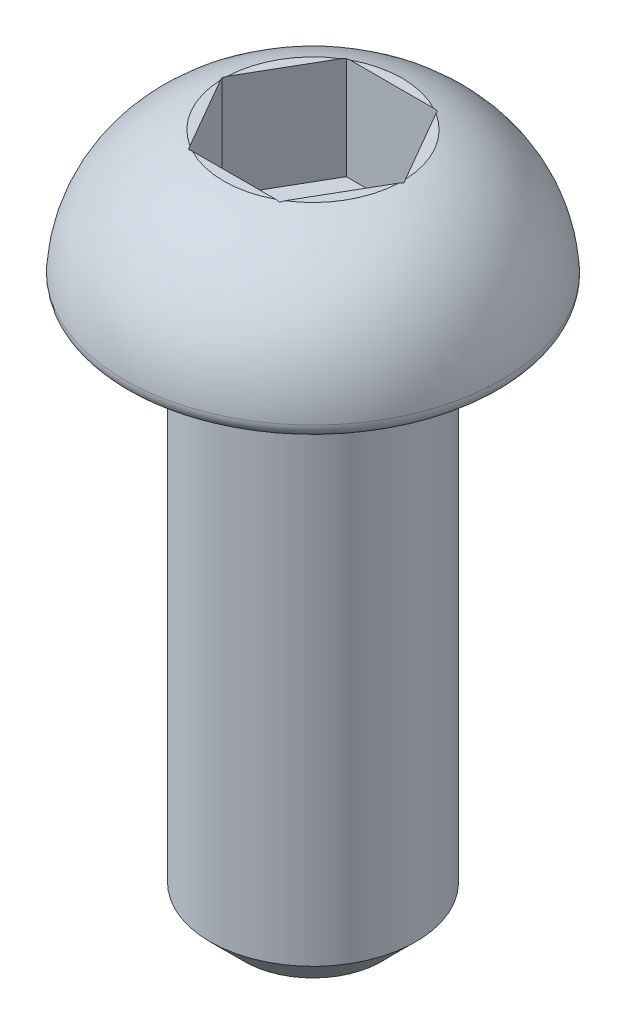
ISO-10303-21;
HEADER;
FILE_DESCRIPTION(('STEP AP214'),'2;1');
FILE_NAME('part.step','',(''),(''),'','','');
FILE_SCHEMA(('AUTOMOTIVE_DESIGN { 1 0 10303 214 1 1 1 1 }'));
ENDSEC;
DATA;
#1=APPLICATION_CONTEXT('core data for automotive mechanical design processes');
#2=APPLICATION_PROTOCOL_DEFINITION('international standard','automotive_design',2000,#1);
#3=PRODUCT_CONTEXT('',#1,'mechanical');
#4=PRODUCT('Part','Part','',(#3));
#5=PRODUCT_RELATED_PRODUCT_CATEGORY('part','',(#4));
#6=PRODUCT_DEFINITION_FORMATION('','',#4);
#7=PRODUCT_DEFINITION_CONTEXT('part definition',#1,'design');
#8=PRODUCT_DEFINITION('design','',#6,#7);
#9=PRODUCT_DEFINITION_SHAPE('','',#8);
#10=(LENGTH_UNIT() NAMED_UNIT(*) SI_UNIT(.MILLI.,.METRE.));
#11=(NAMED_UNIT(*) PLANE_ANGLE_UNIT() SI_UNIT($,.RADIAN.));
#12=(NAMED_UNIT(*) SI_UNIT($,.STERADIAN.) SOLID_ANGLE_UNIT());
#13=UNCERTAINTY_MEASURE_WITH_UNIT(LENGTH_MEASURE(1.E-05),#10,'distance_accuracy_value','');
#14=(GEOMETRIC_REPRESENTATION_CONTEXT(3) GLOBAL_UNCERTAINTY_ASSIGNED_CONTEXT((#13)) GLOBAL_UNIT_ASSIGNED_CONTEXT((#10,
#11,#12)) REPRESENTATION_CONTEXT('',''));
#15=CARTESIAN_POINT('',(0.,0.,0.));
#16=DIRECTION('',(0.,0.,1.));
#17=DIRECTION('',(1.,0.,0.));
#18=AXIS2_PLACEMENT_3D('',#15,#16,#17);
#19=CARTESIAN_POINT('',(0.,0.,0.));
#20=DIRECTION('',(0.,-1.,0.));
#21=DIRECTION('',(0.,0.,-1.));
#22=AXIS2_PLACEMENT_3D('',#19,#20,#21);
#23=PLANE('',#22);
#24=CARTESIAN_POINT('',(0.,0.,0.));
#25=DIRECTION('',(0.,-1.,0.));
#26=DIRECTION('',(0.,0.,-1.));
#27=AXIS2_PLACEMENT_3D('',#24,#25,#26);
#28=CIRCLE('',#27,2.54724235554234);
#29=CARTESIAN_POINT('',(0.,0.,-2.54724235554234));
#30=VERTEX_POINT('',#29);
#31=EDGE_CURVE('E186',#30,#30,#28,.T.);
#32=ORIENTED_EDGE('',*,*,#31,.T.);
#33=EDGE_LOOP('',(#32));
#34=FACE_BOUND('',#33,.T.);
#35=CARTESIAN_POINT('',(0.,0.,0.));
#36=DIRECTION('',(0.,-1.,0.));
#37=DIRECTION('',(0.,0.,-1.));
#38=AXIS2_PLACEMENT_3D('',#35,#36,#37);
#39=CIRCLE('',#38,1.5);
#40=CARTESIAN_POINT('',(0.,0.,-1.5));
#41=VERTEX_POINT('',#40);
#42=EDGE_CURVE('E152',#41,#41,#39,.T.);
#43=ORIENTED_EDGE('',*,*,#42,.F.);
#44=EDGE_LOOP('',(#43));
#45=FACE_BOUND('',#44,.T.);
#46=ADVANCED_FACE('F34',(#34,#45),#23,.T.);
#47=CARTESIAN_POINT('',(0.,2.,0.));
#48=DIRECTION('',(0.,1.,0.));
#49=DIRECTION('',(0.,0.,1.));
#50=AXIS2_PLACEMENT_3D('',#47,#48,#49);
#51=PLANE('',#50);
#52=DIRECTION('',(0.5,0.,-0.866025403784439));
#53=VECTOR('',#52,1.);
#54=CARTESIAN_POINT('',(0.66395280956807,2.,1.15));
#55=LINE('',#54,#53);
#56=CARTESIAN_POINT('',(0.692820323027552,2.,1.1));
#57=VERTEX_POINT('',#56);
#58=CARTESIAN_POINT('',(1.29903810567666,2.,0.0499999999999994));
#59=VERTEX_POINT('',#58);
#60=EDGE_CURVE('E161',#57,#59,#55,.T.);
#61=ORIENTED_EDGE('',*,*,#60,.F.);
#62=CARTESIAN_POINT('',(0.,2.,0.));
#63=DIRECTION('',(0.,-1.,0.));
#64=DIRECTION('',(0.,0.,-1.));
#65=AXIS2_PLACEMENT_3D('',#62,#63,#64);
#66=CIRCLE('',#65,1.3);
#67=EDGE_CURVE('E314',#59,#57,#66,.T.);
#68=ORIENTED_EDGE('',*,*,#67,.F.);
#69=EDGE_LOOP('',(#61,#68));
#70=FACE_BOUND('',#69,.T.);
#71=ADVANCED_FACE('F282',(#70),#51,.T.);
#72=DIRECTION('',(1.,0.,0.));
#73=VECTOR('',#72,1.);
#74=CARTESIAN_POINT('',(-0.66395280956807,2.,1.15));
#75=LINE('',#74,#73);
#76=CARTESIAN_POINT('',(-0.606217782649107,2.,1.15));
#77=VERTEX_POINT('',#76);
#78=CARTESIAN_POINT('',(0.606217782649107,2.,1.15));
#79=VERTEX_POINT('',#78);
#80=EDGE_CURVE('E147',#77,#79,#75,.T.);
#81=ORIENTED_EDGE('',*,*,#80,.F.);
#82=EDGE_CURVE('E316',#79,#77,#66,.T.);
#83=ORIENTED_EDGE('',*,*,#82,.F.);
#84=EDGE_LOOP('',(#81,#83));
#85=FACE_BOUND('',#84,.T.);
#86=ADVANCED_FACE('F288',(#85),#51,.T.);
#87=DIRECTION('',(0.5,0.,0.866025403784438));
#88=VECTOR('',#87,1.);
#89=CARTESIAN_POINT('',(-1.32790561913614,2.,0.));
#90=LINE('',#89,#88);
#91=CARTESIAN_POINT('',(-1.29903810567666,2.,0.0500000000000002));
#92=VERTEX_POINT('',#91);
#93=CARTESIAN_POINT('',(-0.692820323027551,2.,1.1));
#94=VERTEX_POINT('',#93);
#95=EDGE_CURVE('E149',#92,#94,#90,.T.);
#96=ORIENTED_EDGE('',*,*,#95,.F.);
#97=EDGE_CURVE('E318',#94,#92,#66,.T.);
#98=ORIENTED_EDGE('',*,*,#97,.F.);
#99=EDGE_LOOP('',(#96,#98));
#100=FACE_BOUND('',#99,.T.);
#101=ADVANCED_FACE('F342',(#100),#51,.T.);
#102=DIRECTION('',(-0.5,0.,0.866025403784439));
#103=VECTOR('',#102,1.);
#104=CARTESIAN_POINT('',(-0.66395280956807,2.,-1.15));
#105=LINE('',#104,#103);
#106=CARTESIAN_POINT('',(-0.692820323027551,2.,-1.1));
#107=VERTEX_POINT('',#106);
#108=CARTESIAN_POINT('',(-1.29903810567666,2.,-0.0500000000000003));
#109=VERTEX_POINT('',#108);
#110=EDGE_CURVE('E166',#107,#109,#105,.T.);
#111=ORIENTED_EDGE('',*,*,#110,.F.);
#112=EDGE_CURVE('E184',#109,#107,#66,.T.);
#113=ORIENTED_EDGE('',*,*,#112,.F.);
#114=EDGE_LOOP('',(#111,#113));
#115=FACE_BOUND('',#114,.T.);
#116=ADVANCED_FACE('F331',(#115),#51,.T.);
#117=DIRECTION('',(-1.,0.,0.));
#118=VECTOR('',#117,1.);
#119=CARTESIAN_POINT('',(0.663952809568069,2.,-1.15));
#120=LINE('',#119,#118);
#121=CARTESIAN_POINT('',(0.606217782649107,2.,-1.15));
#122=VERTEX_POINT('',#121);
#123=CARTESIAN_POINT('',(-0.606217782649107,2.,-1.15));
#124=VERTEX_POINT('',#123);
#125=EDGE_CURVE('E164',#122,#124,#120,.T.);
#126=ORIENTED_EDGE('',*,*,#125,.F.);
#127=EDGE_CURVE('E171',#124,#122,#66,.T.);
#128=ORIENTED_EDGE('',*,*,#127,.F.);
#129=EDGE_LOOP('',(#126,#128));
#130=FACE_BOUND('',#129,.T.);
#131=ADVANCED_FACE('F307',(#130),#51,.T.);
#132=DIRECTION('',(-0.5,0.,-0.866025403784438));
#133=VECTOR('',#132,1.);
#134=CARTESIAN_POINT('',(1.32790561913614,2.,0.));
#135=LINE('',#134,#133);
#136=CARTESIAN_POINT('',(1.29903810567666,2.,-0.0499999999999994));
#137=VERTEX_POINT('',#136);
#138=CARTESIAN_POINT('',(0.69282032302755,2.,-1.1));
#139=VERTEX_POINT('',#138);
#140=EDGE_CURVE('E49',#137,#139,#135,.T.);
#141=ORIENTED_EDGE('',*,*,#140,.F.);
#142=EDGE_CURVE('E185',#139,#137,#66,.T.);
#143=ORIENTED_EDGE('',*,*,#142,.F.);
#144=EDGE_LOOP('',(#141,#143));
#145=FACE_BOUND('',#144,.T.);
#146=ADVANCED_FACE('F290',(#145),#51,.T.);
#147=CARTESIAN_POINT('',(0.,0.076691427643514,0.));
#148=DIRECTION('',(0.,-1.,0.));
#149=DIRECTION('',(0.,0.,-1.));
#150=AXIS2_PLACEMENT_3D('',#147,#148,#149);
#151=DEGENERATE_TOROIDAL_SURFACE('',#150,0.751470934680709,2.,.T.);
#152=CARTESIAN_POINT('',(0.663837339514232,1.99178669993929,1.1502));
#153=CARTESIAN_POINT('',(0.66878717333089,1.99327644137946,1.14162663634053));
#154=CARTESIAN_POINT('',(0.673740102582228,1.99472242054365,1.13304791123091));
#155=CARTESIAN_POINT('',(0.683652150360132,1.99752685386907,1.11587974087253));
#156=CARTESIAN_POINT('',(0.688611268884708,1.99888530805844,1.10729029562721));
#157=CARTESIAN_POINT('',(0.693573482841972,2.0002,1.0986954889352));
#158=B_SPLINE_CURVE_WITH_KNOTS('',3,(#152,#153,#154,#155,#156,#157),.UNSPECIFIED.,.F.,.F.,(4,2,
4),(0.,0.0300325156416312,0.0600650216231519),.UNSPECIFIED.);
#159=CARTESIAN_POINT('',(0.66395280956807,1.99182146358279,1.15));
#160=VERTEX_POINT('',#159);
#161=EDGE_CURVE('E264',#160,#57,#158,.T.);
#162=ORIENTED_EDGE('',*,*,#161,.F.);
#163=CARTESIAN_POINT('',(0.,2.03658290017349,1.15));
#164=CARTESIAN_POINT('',(0.098646218600147,2.03658732143362,1.15));
#165=CARTESIAN_POINT('',(0.197295101956486,2.03408796152423,1.15));
#166=CARTESIAN_POINT('',(0.394304837949951,2.02310682474313,1.15));
#167=CARTESIAN_POINT('',(0.492665658489158,2.01462440489486,1.15));
#168=CARTESIAN_POINT('',(0.687609728686378,1.98957726871187,1.15));
#169=CARTESIAN_POINT('',(0.784200929312974,1.97307885273518,1.15));
#170=CARTESIAN_POINT('',(0.975057818596466,1.93000622100407,1.15));
#171=CARTESIAN_POINT('',(1.06932598789786,1.90344329758489,1.15));
#172=CARTESIAN_POINT('',(1.27000942224647,1.83324426296719,1.15));
#173=CARTESIAN_POINT('',(1.37568972004873,1.78744372549576,1.15));
#174=CARTESIAN_POINT('',(1.57845042818664,1.67924757225634,1.15));
#175=CARTESIAN_POINT('',(1.67551966120083,1.61683079666585,1.15));
#176=CARTESIAN_POINT('',(1.8578430964694,1.47582375887711,1.15));
#177=CARTESIAN_POINT('',(1.94304549944359,1.39716609459964,1.15));
#178=CARTESIAN_POINT('',(2.09784101718846,1.22574174763031,1.15));
#179=CARTESIAN_POINT('',(2.16743940990664,1.13297985346576,1.15));
#180=CARTESIAN_POINT('',(2.28431419983866,0.94263887552125,1.15));
#181=CARTESIAN_POINT('',(2.33275383814089,0.845772961604736,1.15));
#182=CARTESIAN_POINT('',(2.41188684890319,0.645049587695764,1.15));
#183=CARTESIAN_POINT('',(2.44258507109003,0.541194047036149,1.15));
#184=CARTESIAN_POINT('',(2.48427081779776,0.334046404725987,1.15));
#185=CARTESIAN_POINT('',(2.49601517014892,0.230905918770504,1.15));
#186=CARTESIAN_POINT('',(2.50179966751879,0.0241281883602649,1.15));
#187=CARTESIAN_POINT('',(2.49584075628937,-0.0795090293199227,1.15));
#188=CARTESIAN_POINT('',(2.46658780707738,-0.283077440217687,1.15));
#189=CARTESIAN_POINT('',(2.44349452160948,-0.383037592772008,1.15));
#190=CARTESIAN_POINT('',(2.38096161026423,-0.577676291567684,1.15));
#191=CARTESIAN_POINT('',(2.34152541798826,-0.672355942490544,1.15));
#192=CARTESIAN_POINT('',(2.24727327907491,-0.854473591721951,1.15));
#193=CARTESIAN_POINT('',(2.19236137755517,-0.941861853863798,1.15));
#194=CARTESIAN_POINT('',(2.06898309304621,-1.10654284237712,1.15));
#195=CARTESIAN_POINT('',(2.00050758110401,-1.18382871088677,1.15));
#196=CARTESIAN_POINT('',(1.85001098526993,-1.32858936571327,1.15));
#197=CARTESIAN_POINT('',(1.76765450591879,-1.3957143916501,1.15));
#198=CARTESIAN_POINT('',(1.59361449911652,-1.51612024156412,1.15));
#199=CARTESIAN_POINT('',(1.50194689329583,-1.56942416234802,1.15));
#200=CARTESIAN_POINT('',(1.3442167468046,-1.64633505265362,1.15));
#201=CARTESIAN_POINT('',(1.28002488900966,-1.67388067349761,1.15));
#202=CARTESIAN_POINT('',(1.14942569560088,-1.72309655156327,1.15));
#203=CARTESIAN_POINT('',(1.08301829059227,-1.74476662455823,1.15));
#204=CARTESIAN_POINT('',(0.948299721594118,-1.78271208504272,1.15));
#205=CARTESIAN_POINT('',(0.879979992399287,-1.79895664735316,1.15));
#206=CARTESIAN_POINT('',(0.742372225887791,-1.82648676897236,1.15));
#207=CARTESIAN_POINT('',(0.673084213384437,-1.83777245511816,1.15));
#208=CARTESIAN_POINT('',(0.491428640373657,-1.8618030535964,1.15));
#209=CARTESIAN_POINT('',(0.378625107961637,-1.87122074908676,1.15));
#210=CARTESIAN_POINT('',(0.209143758579499,-1.87958699044929,1.15));
#211=CARTESIAN_POINT('',(0.152562345228347,-1.88141490888953,1.15));
#212=CARTESIAN_POINT('',(0.0393669602172776,-1.88335114487218,1.15));
#213=CARTESIAN_POINT('',(-0.0172470100143041,-1.883459532838,1.15));
#214=CARTESIAN_POINT('',(-0.130350030932136,-1.88197557574409,1.15));
#215=CARTESIAN_POINT('',(-0.186839119823327,-1.88038635915171,1.15));
#216=CARTESIAN_POINT('',(-0.299728920798325,-1.87531771771226,1.15));
#217=CARTESIAN_POINT('',(-0.356129628836693,-1.87183820873768,1.15));
#218=CARTESIAN_POINT('',(-0.524916952582429,-1.85805049067533,1.15));
#219=CARTESIAN_POINT('',(-0.637092371817397,-1.84439266677423,1.15));
#220=CARTESIAN_POINT('',(-0.810017493876797,-1.81361696288777,1.15));
#221=CARTESIAN_POINT('',(-0.871521077506692,-1.80071656706703,1.15));
#222=CARTESIAN_POINT('',(-0.993496408589721,-1.77064052799502,1.15));
#223=CARTESIAN_POINT('',(-1.05396806098029,-1.75346449311514,1.15));
#224=CARTESIAN_POINT('',(-1.17323439190626,-1.71454198802947,1.15));
#225=CARTESIAN_POINT('',(-1.2320335047974,-1.69280919801169,1.15));
#226=CARTESIAN_POINT('',(-1.34764514507638,-1.64452542038476,1.15));
#227=CARTESIAN_POINT('',(-1.40445721463237,-1.61797333097724,1.15));
#228=CARTESIAN_POINT('',(-1.51607405614635,-1.55969669663654,1.15));
#229=CARTESIAN_POINT('',(-1.57085410804412,-1.52792462132762,1.15));
#230=CARTESIAN_POINT('',(-1.67726545993891,-1.45943403628238,1.15));
#231=CARTESIAN_POINT('',(-1.72889554802264,-1.42271363995312,1.15));
#232=CARTESIAN_POINT('',(-1.82847105838098,-1.34445894230347,1.15));
#233=CARTESIAN_POINT('',(-1.87641252573548,-1.30291959053453,1.15));
#234=CARTESIAN_POINT('',(-1.9680035552563,-1.21534492943057,1.15));
#235=CARTESIAN_POINT('',(-2.01165174969555,-1.16930819659477,1.15));
#236=CARTESIAN_POINT('',(-2.12614975655006,-1.03572622565891,1.15));
#237=CARTESIAN_POINT('',(-2.19186050387076,-0.943665750390142,1.15));
#238=CARTESIAN_POINT('',(-2.30546191326039,-0.749288259753581,1.15));
#239=CARTESIAN_POINT('',(-2.35337031200657,-0.646981582540756,1.15));
#240=CARTESIAN_POINT('',(-2.42703869947872,-0.442585671523526,1.15));
#241=CARTESIAN_POINT('',(-2.45409068083514,-0.340961259178402,1.15));
#242=CARTESIAN_POINT('',(-2.49032992545249,-0.134567326214733,1.15));
#243=CARTESIAN_POINT('',(-2.49951787124879,-0.0297979259127926,1.15));
#244=CARTESIAN_POINT('',(-2.49971519023315,0.177457556639515,1.15));
#245=CARTESIAN_POINT('',(-2.49111740474565,0.279943506757529,1.15));
#246=CARTESIAN_POINT('',(-2.45681698932696,0.482000924000085,1.15));
#247=CARTESIAN_POINT('',(-2.43111591392285,0.581572655140941,1.15));
#248=CARTESIAN_POINT('',(-2.36347334234934,0.774935615001325,1.15));
#249=CARTESIAN_POINT('',(-2.32154526289618,0.868731545166596,1.15));
#250=CARTESIAN_POINT('',(-2.22279701257776,1.04811167401887,1.15));
#251=CARTESIAN_POINT('',(-2.16597630912103,1.13369557887707,1.15));
#252=CARTESIAN_POINT('',(-2.03810854833738,1.29594922041055,1.15));
#253=CARTESIAN_POINT('',(-1.96682676359936,1.37243365695663,1.15));
#254=CARTESIAN_POINT('',(-1.81295905623226,1.51300240336353,1.15));
#255=CARTESIAN_POINT('',(-1.73037090646585,1.57708426413665,1.15));
#256=CARTESIAN_POINT('',(-1.5520613820707,1.69471516717586,1.15));
#257=CARTESIAN_POINT('',(-1.45589046579648,1.74757961403836,1.15));
#258=CARTESIAN_POINT('',(-1.25692243260643,1.83837035879711,1.15));
#259=CARTESIAN_POINT('',(-1.15413109373742,1.87630948273586,1.15));
#260=CARTESIAN_POINT('',(-0.964938329481516,1.93242013134816,1.15));
#261=CARTESIAN_POINT('',(-0.879225780531216,1.95299866436732,1.15));
#262=CARTESIAN_POINT('',(-0.706280939870257,1.98646029403696,1.15));
#263=CARTESIAN_POINT('',(-0.6190475593282,1.9993376228744,1.15));
#264=CARTESIAN_POINT('',(-0.443289273005161,2.01901301040914,1.15));
#265=CARTESIAN_POINT('',(-0.354759586940948,2.02576557714995,1.15));
#266=CARTESIAN_POINT('',(-0.17748732142704,2.03454856601354,1.15));
#267=CARTESIAN_POINT('',(-0.0887447390438819,2.03657892269132,1.15));
#268=CARTESIAN_POINT('',(0.,2.03658290017349,1.15));
#269=B_SPLINE_CURVE_WITH_KNOTS('',3,(#163,#164,#165,#166,#167,#168,#169,#170,#171,#172,#173,
#174,#175,#176,#177,#178,#179,#180,#181,#182,#183,#184,#185,#186,#187,#188,#189,#190,#191,#192,
#193,#194,#195,#196,#197,#198,#199,#200,#201,#202,#203,#204,#205,#206,#207,#208,#209,#210,#211,
#212,#213,#214,#215,#216,#217,#218,#219,#220,#221,#222,#223,#224,#225,#226,#227,#228,#229,#230,
#231,#232,#233,#234,#235,#236,#237,#238,#239,#240,#241,#242,#243,#244,#245,#246,#247,#248,#249,
#250,#251,#252,#253,#254,#255,#256,#257,#258,#259,#260,#261,#262,#263,#264,#265,#266,#267,#268),
.UNSPECIFIED.,.T.,.F.,(4,2,2,2,2,2,2,2,2,2,2,2,2,2,2,2,2,2,2,2,2,2,2,2,2,2,2,2,2,2,2,2,2,2,2,2,
2,2,2,2,2,2,2,2,2,2,2,2,2,2,2,2,4),(0.,0.295902440396797,0.591836685142885,0.88536388192649,
1.1785627130153,1.52269996813138,1.86727757612131,2.21331506104864,2.5592353240376,
2.88250449229488,3.2056852510601,3.51561009227793,3.82551841185847,4.13185195746594,
4.43812117581053,4.74633280791623,5.05475259026988,5.37212175852073,5.68895709402482,
5.89824437929793,6.10753822597639,6.31800171851667,6.52845982755554,6.86760372007158,
7.03742508416335,7.20723949320035,7.37674149510497,7.54625104131724,7.8846605033158,
8.07306010337971,8.26147696632307,8.44933606655962,8.63723816976182,8.82695710833894,
9.01674858473973,9.20674079803173,9.39679334327464,9.73415597564318,10.0711815829047,
10.3851290507443,10.6990645232839,11.0061400458043,11.3131876618792,11.6199819471461,
11.9267872055172,12.2390410643218,12.5513565198947,12.8792462443636,13.2068535787986,
13.4709069754266,13.7351578878529,14.0013558354432,14.267557472243),.UNSPECIFIED.);
#270=EDGE_CURVE('E57',#79,#160,#269,.T.);
#271=ORIENTED_EDGE('',*,*,#270,.F.);
#272=ORIENTED_EDGE('',*,*,#82,.T.);
#273=CARTESIAN_POINT('',(-0.66395280956807,1.99182146358212,1.15));
#274=VERTEX_POINT('',#273);
#275=EDGE_CURVE('E260',#274,#77,#269,.T.);
#276=ORIENTED_EDGE('',*,*,#275,.F.);
#277=CARTESIAN_POINT('',(-0.693573482841972,2.0002,1.0986954889352));
#278=CARTESIAN_POINT('',(-0.688611268884708,1.99888530805844,1.10729029562721));
#279=CARTESIAN_POINT('',(-0.683652150360132,1.99752685386907,1.11587974087253));
#280=CARTESIAN_POINT('',(-0.673740102582228,1.99472242054365,1.13304791123091));
#281=CARTESIAN_POINT('',(-0.66878717333089,1.99327644137946,1.14162663634053));
#282=CARTESIAN_POINT('',(-0.663837339514232,1.99178669993929,1.1502));
#283=B_SPLINE_CURVE_WITH_KNOTS('',3,(#277,#278,#279,#280,#281,#282),.UNSPECIFIED.,.F.,.F.,(4,2,
4),(0.,0.0300325059815209,0.0600650216231522),.UNSPECIFIED.);
#284=EDGE_CURVE('E255',#94,#274,#283,.T.);
#285=ORIENTED_EDGE('',*,*,#284,.F.);
#286=ORIENTED_EDGE('',*,*,#97,.T.);
#287=CARTESIAN_POINT('',(-1.32802108918998,1.99178669993929,-0.000199999999999881));
#288=CARTESIAN_POINT('',(-1.32307125537332,1.99327644137946,0.00837336365947469));
#289=CARTESIAN_POINT('',(-1.31811832612198,1.99472242054365,0.0169520887690861));
#290=CARTESIAN_POINT('',(-1.30820627834408,1.99752685386907,0.0341202591274678));
#291=CARTESIAN_POINT('',(-1.3032471598195,1.99888530805844,0.0427097043727891));
#292=CARTESIAN_POINT('',(-1.29828494586224,2.0002,0.0513045110647981));
#293=B_SPLINE_CURVE_WITH_KNOTS('',3,(#287,#288,#289,#290,#291,#292),.UNSPECIFIED.,.F.,.F.,(4,2,
4),(0.,0.030032515641632,0.0600650216231535),.UNSPECIFIED.);
#294=CARTESIAN_POINT('',(-1.32790561913614,1.99182146358212,0.));
#295=VERTEX_POINT('',#294);
#296=EDGE_CURVE('E250',#295,#92,#293,.T.);
#297=ORIENTED_EDGE('',*,*,#296,.F.);
#298=CARTESIAN_POINT('',(-1.29828494586224,2.0002,-0.0513045110647978));
#299=CARTESIAN_POINT('',(-1.3032471598195,1.99888530805844,-0.0427097043727888));
#300=CARTESIAN_POINT('',(-1.30820627834408,1.99752685386907,-0.0341202591274676));
#301=CARTESIAN_POINT('',(-1.31811832612198,1.99472242054365,-0.016952088769086));
#302=CARTESIAN_POINT('',(-1.32307125537332,1.99327644137946,-0.00837336365947457));
#303=CARTESIAN_POINT('',(-1.32802108918998,1.99178669993929,0.000199999999999972));
#304=B_SPLINE_CURVE_WITH_KNOTS('',3,(#298,#299,#300,#301,#302,#303),.UNSPECIFIED.,.F.,.F.,(4,2,
4),(0.,0.0300325059815215,0.0600650216231534),.UNSPECIFIED.);
#305=EDGE_CURVE('E230',#109,#295,#304,.T.);
#306=ORIENTED_EDGE('',*,*,#305,.F.);
#307=ORIENTED_EDGE('',*,*,#112,.T.);
#308=CARTESIAN_POINT('',(-0.663837339514232,1.99178669993929,-1.1502));
#309=CARTESIAN_POINT('',(-0.66878717333089,1.99327644137946,-1.14162663634053));
#310=CARTESIAN_POINT('',(-0.673740102582228,1.99472242054365,-1.13304791123091));
#311=CARTESIAN_POINT('',(-0.683652150360133,1.99752685386907,-1.11587974087253));
#312=CARTESIAN_POINT('',(-0.688611268884709,1.99888530805844,-1.10729029562721));
#313=CARTESIAN_POINT('',(-0.693573482841973,2.0002,-1.0986954889352));
#314=B_SPLINE_CURVE_WITH_KNOTS('',3,(#308,#309,#310,#311,#312,#313),.UNSPECIFIED.,.F.,.F.,(4,2,
4),(0.,0.0300325156416316,0.0600650216231527),.UNSPECIFIED.);
#315=CARTESIAN_POINT('',(-0.66395280956807,1.99182146358279,-1.15));
#316=VERTEX_POINT('',#315);
#317=EDGE_CURVE('E225',#316,#107,#314,.T.);
#318=ORIENTED_EDGE('',*,*,#317,.F.);
#319=CARTESIAN_POINT('',(0.,2.03658290017349,-1.15));
#320=CARTESIAN_POINT('',(-0.0986462186001475,2.03658732143362,-1.15));
#321=CARTESIAN_POINT('',(-0.197295101956487,2.03408796152423,-1.15));
#322=CARTESIAN_POINT('',(-0.394304837949951,2.02310682474313,-1.15));
#323=CARTESIAN_POINT('',(-0.492665658489158,2.01462440489486,-1.15));
#324=CARTESIAN_POINT('',(-0.687609728686379,1.98957726871187,-1.15));
#325=CARTESIAN_POINT('',(-0.784200929312975,1.97307885273518,-1.15));
#326=CARTESIAN_POINT('',(-0.975057818596467,1.93000622100407,-1.15));
#327=CARTESIAN_POINT('',(-1.06932598789786,1.90344329758489,-1.15));
#328=CARTESIAN_POINT('',(-1.27000942224647,1.83324426296719,-1.15));
#329=CARTESIAN_POINT('',(-1.37568972004873,1.78744372549576,-1.15));
#330=CARTESIAN_POINT('',(-1.57845042818664,1.67924757225634,-1.15));
#331=CARTESIAN_POINT('',(-1.67551966120083,1.61683079666585,-1.15));
#332=CARTESIAN_POINT('',(-1.8578430964694,1.47582375887711,-1.15));
#333=CARTESIAN_POINT('',(-1.94304549944359,1.39716609459964,-1.15));
#334=CARTESIAN_POINT('',(-2.09784101718846,1.22574174763031,-1.15));
#335=CARTESIAN_POINT('',(-2.16743940990664,1.13297985346576,-1.15));
#336=CARTESIAN_POINT('',(-2.28431419983867,0.942638875521249,-1.15));
#337=CARTESIAN_POINT('',(-2.33275383814089,0.845772961604735,-1.15));
#338=CARTESIAN_POINT('',(-2.41188684890319,0.645049587695763,-1.15));
#339=CARTESIAN_POINT('',(-2.44258507109003,0.541194047036148,-1.15));
#340=CARTESIAN_POINT('',(-2.48427081779776,0.334046404725987,-1.15));
#341=CARTESIAN_POINT('',(-2.49601517014892,0.230905918770504,-1.15));
#342=CARTESIAN_POINT('',(-2.50179966751879,0.0241281883602644,-1.15));
#343=CARTESIAN_POINT('',(-2.49584075628937,-0.0795090293199232,-1.15));
#344=CARTESIAN_POINT('',(-2.46658780707738,-0.283077440217688,-1.15));
#345=CARTESIAN_POINT('',(-2.44349452160948,-0.383037592772009,-1.15));
#346=CARTESIAN_POINT('',(-2.38096161026423,-0.577676291567685,-1.15));
#347=CARTESIAN_POINT('',(-2.34152541798826,-0.672355942490545,-1.15));
#348=CARTESIAN_POINT('',(-2.24727327907491,-0.854473591721952,-1.15));
#349=CARTESIAN_POINT('',(-2.19236137755517,-0.941861853863799,-1.15));
#350=CARTESIAN_POINT('',(-2.06898309304621,-1.10654284237712,-1.15));
#351=CARTESIAN_POINT('',(-2.00050758110401,-1.18382871088677,-1.15));
#352=CARTESIAN_POINT('',(-1.85001098526993,-1.32858936571327,-1.15));
#353=CARTESIAN_POINT('',(-1.76765450591879,-1.3957143916501,-1.15));
#354=CARTESIAN_POINT('',(-1.59361449911652,-1.51612024156412,-1.15));
#355=CARTESIAN_POINT('',(-1.50194689329583,-1.56942416234802,-1.15));
#356=CARTESIAN_POINT('',(-1.3442167468046,-1.64633505265362,-1.15));
#357=CARTESIAN_POINT('',(-1.28002488900966,-1.67388067349761,-1.15));
#358=CARTESIAN_POINT('',(-1.14942569560088,-1.72309655156327,-1.15));
#359=CARTESIAN_POINT('',(-1.08301829059227,-1.74476662455823,-1.15));
#360=CARTESIAN_POINT('',(-0.948299721594117,-1.78271208504273,-1.15));
#361=CARTESIAN_POINT('',(-0.879979992399286,-1.79895664735316,-1.15));
#362=CARTESIAN_POINT('',(-0.74237222588779,-1.82648676897236,-1.15));
#363=CARTESIAN_POINT('',(-0.673084213384436,-1.83777245511816,-1.15));
#364=CARTESIAN_POINT('',(-0.491428640373656,-1.8618030535964,-1.15));
#365=CARTESIAN_POINT('',(-0.378625107961636,-1.87122074908676,-1.15));
#366=CARTESIAN_POINT('',(-0.209143758579498,-1.87958699044929,-1.15));
#367=CARTESIAN_POINT('',(-0.152562345228346,-1.88141490888953,-1.15));
#368=CARTESIAN_POINT('',(-0.0393669602172767,-1.88335114487218,-1.15));
#369=CARTESIAN_POINT('',(0.0172470100143049,-1.883459532838,-1.15));
#370=CARTESIAN_POINT('',(0.130350030932137,-1.88197557574409,-1.15));
#371=CARTESIAN_POINT('',(0.186839119823328,-1.88038635915171,-1.15));
#372=CARTESIAN_POINT('',(0.299728920798326,-1.87531771771226,-1.15));
#373=CARTESIAN_POINT('',(0.356129628836694,-1.87183820873768,-1.15));
#374=CARTESIAN_POINT('',(0.524916952582429,-1.85805049067533,-1.15));
#375=CARTESIAN_POINT('',(0.637092371817398,-1.84439266677423,-1.15));
#376=CARTESIAN_POINT('',(0.810017493876798,-1.81361696288777,-1.15));
#377=CARTESIAN_POINT('',(0.871521077506693,-1.80071656706703,-1.15));
#378=CARTESIAN_POINT('',(0.993496408589723,-1.77064052799502,-1.15));
#379=CARTESIAN_POINT('',(1.05396806098029,-1.75346449311514,-1.15));
#380=CARTESIAN_POINT('',(1.17323439190626,-1.71454198802947,-1.15));
#381=CARTESIAN_POINT('',(1.2320335047974,-1.69280919801169,-1.15));
#382=CARTESIAN_POINT('',(1.34764514507638,-1.64452542038476,-1.15));
#383=CARTESIAN_POINT('',(1.40445721463237,-1.61797333097724,-1.15));
#384=CARTESIAN_POINT('',(1.51607405614635,-1.55969669663654,-1.15));
#385=CARTESIAN_POINT('',(1.57085410804412,-1.52792462132762,-1.15));
#386=CARTESIAN_POINT('',(1.67726545993891,-1.45943403628238,-1.15));
#387=CARTESIAN_POINT('',(1.72889554802264,-1.42271363995312,-1.15));
#388=CARTESIAN_POINT('',(1.82847105838098,-1.34445894230347,-1.15));
#389=CARTESIAN_POINT('',(1.87641252573548,-1.30291959053453,-1.15));
#390=CARTESIAN_POINT('',(1.9680035552563,-1.21534492943057,-1.15));
#391=CARTESIAN_POINT('',(2.01165174969555,-1.16930819659477,-1.15));
#392=CARTESIAN_POINT('',(2.12614975655006,-1.03572622565891,-1.15));
#393=CARTESIAN_POINT('',(2.19186050387076,-0.943665750390142,-1.15));
#394=CARTESIAN_POINT('',(2.30546191326039,-0.749288259753581,-1.15));
#395=CARTESIAN_POINT('',(2.35337031200657,-0.646981582540756,-1.15));
#396=CARTESIAN_POINT('',(2.42703869947872,-0.442585671523526,-1.15));
#397=CARTESIAN_POINT('',(2.45409068083514,-0.340961259178402,-1.15));
#398=CARTESIAN_POINT('',(2.49032992545249,-0.134567326214733,-1.15));
#399=CARTESIAN_POINT('',(2.49951787124879,-0.0297979259127928,-1.15));
#400=CARTESIAN_POINT('',(2.49971519023315,0.177457556639515,-1.15));
#401=CARTESIAN_POINT('',(2.49111740474565,0.279943506757529,-1.15));
#402=CARTESIAN_POINT('',(2.45681698932696,0.482000924000085,-1.15));
#403=CARTESIAN_POINT('',(2.43111591392285,0.581572655140941,-1.15));
#404=CARTESIAN_POINT('',(2.36347334234934,0.774935615001325,-1.15));
#405=CARTESIAN_POINT('',(2.32154526289618,0.868731545166596,-1.15));
#406=CARTESIAN_POINT('',(2.22279701257776,1.04811167401887,-1.15));
#407=CARTESIAN_POINT('',(2.16597630912103,1.13369557887707,-1.15));
#408=CARTESIAN_POINT('',(2.03810854833738,1.29594922041055,-1.15));
#409=CARTESIAN_POINT('',(1.96682676359936,1.37243365695663,-1.15));
#410=CARTESIAN_POINT('',(1.81295905623226,1.51300240336353,-1.15));
#411=CARTESIAN_POINT('',(1.73037090646585,1.57708426413665,-1.15));
#412=CARTESIAN_POINT('',(1.5520613820707,1.69471516717586,-1.15));
#413=CARTESIAN_POINT('',(1.45589046579648,1.74757961403836,-1.15));
#414=CARTESIAN_POINT('',(1.25692243260643,1.83837035879711,-1.15));
#415=CARTESIAN_POINT('',(1.15413109373742,1.87630948273586,-1.15));
#416=CARTESIAN_POINT('',(0.964938329481515,1.93242013134816,-1.15));
#417=CARTESIAN_POINT('',(0.879225780531215,1.95299866436732,-1.15));
#418=CARTESIAN_POINT('',(0.706280939870256,1.98646029403696,-1.15));
#419=CARTESIAN_POINT('',(0.619047559328199,1.9993376228744,-1.15));
#420=CARTESIAN_POINT('',(0.44328927300516,2.01901301040914,-1.15));
#421=CARTESIAN_POINT('',(0.354759586940947,2.02576557714995,-1.15));
#422=CARTESIAN_POINT('',(0.17748732142704,2.03454856601354,-1.15));
#423=CARTESIAN_POINT('',(0.0887447390438815,2.03657892269132,-1.15));
#424=CARTESIAN_POINT('',(0.,2.03658290017349,-1.15));
#425=B_SPLINE_CURVE_WITH_KNOTS('',3,(#319,#320,#321,#322,#323,#324,#325,#326,#327,#328,#329,
#330,#331,#332,#333,#334,#335,#336,#337,#338,#339,#340,#341,#342,#343,#344,#345,#346,#347,#348,
#349,#350,#351,#352,#353,#354,#355,#356,#357,#358,#359,#360,#361,#362,#363,#364,#365,#366,#367,
#368,#369,#370,#371,#372,#373,#374,#375,#376,#377,#378,#379,#380,#381,#382,#383,#384,#385,#386,
#387,#388,#389,#390,#391,#392,#393,#394,#395,#396,#397,#398,#399,#400,#401,#402,#403,#404,#405,
#406,#407,#408,#409,#410,#411,#412,#413,#414,#415,#416,#417,#418,#419,#420,#421,#422,#423,#424),
.UNSPECIFIED.,.T.,.F.,(4,2,2,2,2,2,2,2,2,2,2,2,2,2,2,2,2,2,2,2,2,2,2,2,2,2,2,2,2,2,2,2,2,2,2,2,
2,2,2,2,2,2,2,2,2,2,2,2,2,2,2,2,4),(0.,0.295902440396797,0.591836685142885,0.88536388192649,
1.1785627130153,1.52269996813138,1.86727757612131,2.21331506104864,2.5592353240376,
2.88250449229488,3.2056852510601,3.51561009227793,3.82551841185847,4.13185195746594,
4.43812117581053,4.74633280791623,5.05475259026988,5.37212175852073,5.68895709402482,
5.89824437929793,6.10753822597639,6.31800171851667,6.52845982755554,6.86760372007158,
7.03742508416334,7.20723949320035,7.37674149510497,7.54625104131724,7.8846605033158,
8.07306010337971,8.26147696632306,8.44933606655962,8.63723816976182,8.82695710833893,
9.01674858473973,9.20674079803173,9.39679334327464,9.73415597564318,10.0711815829047,
10.3851290507443,10.6990645232839,11.0061400458043,11.3131876618792,11.6199819471461,
11.9267872055172,12.2390410643218,12.5513565198947,12.8792462443636,13.2068535787986,
13.4709069754266,13.7351578878529,14.0013558354432,14.2675574722429),.UNSPECIFIED.);
#426=EDGE_CURVE('E224',#124,#316,#425,.T.);
#427=ORIENTED_EDGE('',*,*,#426,.F.);
#428=ORIENTED_EDGE('',*,*,#127,.T.);
#429=CARTESIAN_POINT('',(0.663952809568069,1.99182146358212,-1.15));
#430=VERTEX_POINT('',#429);
#431=EDGE_CURVE('E199',#430,#122,#425,.T.);
#432=ORIENTED_EDGE('',*,*,#431,.F.);
#433=CARTESIAN_POINT('',(0.693573482841971,2.0002,-1.0986954889352));
#434=CARTESIAN_POINT('',(0.688611268884707,1.99888530805844,-1.10729029562721));
#435=CARTESIAN_POINT('',(0.683652150360131,1.99752685386907,-1.11587974087253));
#436=CARTESIAN_POINT('',(0.673740102582227,1.99472242054365,-1.13304791123091));
#437=CARTESIAN_POINT('',(0.668787173330889,1.99327644137946,-1.14162663634053));
#438=CARTESIAN_POINT('',(0.663837339514231,1.99178669993929,-1.1502));
#439=B_SPLINE_CURVE_WITH_KNOTS('',3,(#433,#434,#435,#436,#437,#438),.UNSPECIFIED.,.F.,.F.,(4,2,
4),(0.,0.0300325059815199,0.0600650216231502),.UNSPECIFIED.);
#440=EDGE_CURVE('E192',#139,#430,#439,.T.);
#441=ORIENTED_EDGE('',*,*,#440,.F.);
#442=ORIENTED_EDGE('',*,*,#142,.T.);
#443=CARTESIAN_POINT('',(1.32802108918998,1.99178669993929,0.000199999999999741));
#444=CARTESIAN_POINT('',(1.32307125537332,1.99327644137946,-0.00837336365947432));
#445=CARTESIAN_POINT('',(1.31811832612198,1.99472242054365,-0.0169520887690852));
#446=CARTESIAN_POINT('',(1.30820627834408,1.99752685386907,-0.034120259127466));
#447=CARTESIAN_POINT('',(1.3032471598195,1.99888530805844,-0.0427097043727867));
#448=CARTESIAN_POINT('',(1.29828494586224,2.0002,-0.0513045110647953));
#449=B_SPLINE_CURVE_WITH_KNOTS('',3,(#443,#444,#445,#446,#447,#448),.UNSPECIFIED.,.F.,.F.,(4,2,
4),(0.,0.0300325156416303,0.0600650216231501),.UNSPECIFIED.);
#450=CARTESIAN_POINT('',(1.32790561913614,1.99182146358279,0.));
#451=VERTEX_POINT('',#450);
#452=EDGE_CURVE('E215',#451,#137,#449,.T.);
#453=ORIENTED_EDGE('',*,*,#452,.F.);
#454=CARTESIAN_POINT('',(1.29828494586224,2.0002,0.0513045110647961));
#455=CARTESIAN_POINT('',(1.3032471598195,1.99888530805844,0.0427097043727873));
#456=CARTESIAN_POINT('',(1.30820627834408,1.99752685386907,0.0341202591274664));
#457=CARTESIAN_POINT('',(1.31811832612198,1.99472242054365,0.0169520887690852));
#458=CARTESIAN_POINT('',(1.32307125537332,1.99327644137946,0.00837336365947403));
#459=CARTESIAN_POINT('',(1.32802108918998,1.99178669993929,-0.00020000000000029));
#460=B_SPLINE_CURVE_WITH_KNOTS('',3,(#454,#455,#456,#457,#458,#459),.UNSPECIFIED.,.F.,.F.,(4,2,
4),(0.,0.0300325059815206,0.0600650216231517),.UNSPECIFIED.);
#461=EDGE_CURVE('E130',#59,#451,#460,.T.);
#462=ORIENTED_EDGE('',*,*,#461,.F.);
#463=ORIENTED_EDGE('',*,*,#67,.T.);
#464=EDGE_LOOP('',(#162,#271,#272,#276,#285,#286,#297,#306,#307,#318,#427,#428,#432,#441,#442,
#453,#462,#463));
#465=FACE_BOUND('',#464,.T.);
#466=CARTESIAN_POINT('',(0.,0.213700952484054,0.));
#467=DIRECTION('',(0.,-1.,0.));
#468=DIRECTION('',(0.,0.,-1.));
#469=AXIS2_PLACEMENT_3D('',#466,#467,#468);
#470=CIRCLE('',#469,2.74677251341586);
#471=CARTESIAN_POINT('',(0.,0.213700952484054,-2.74677251341586));
#472=VERTEX_POINT('',#471);
#473=EDGE_CURVE('E189',#472,#472,#470,.F.);
#474=ORIENTED_EDGE('',*,*,#473,.T.);
#475=EDGE_LOOP('',(#474));
#476=FACE_BOUND('',#475,.T.);
#477=ADVANCED_FACE('F204',(#465,#476),#151,.T.);
#478=CARTESIAN_POINT('',(0.,0.2,0.));
#479=DIRECTION('',(0.,-1.,0.));
#480=DIRECTION('',(0.,0.,-1.));
#481=AXIS2_PLACEMENT_3D('',#478,#479,#480);
#482=TOROIDAL_SURFACE('',#481,2.54724235554234,0.2);
#483=ORIENTED_EDGE('',*,*,#473,.F.);
#484=EDGE_LOOP('',(#483));
#485=FACE_BOUND('',#484,.T.);
#486=ORIENTED_EDGE('',*,*,#31,.F.);
#487=EDGE_LOOP('',(#486));
#488=FACE_BOUND('',#487,.T.);
#489=ADVANCED_FACE('F292',(#485,#488),#482,.T.);
#490=CARTESIAN_POINT('',(0.66395280956807,0.5,1.15));
#491=DIRECTION('',(0.866025403784439,0.,0.499999999999999));
#492=DIRECTION('',(0.5,0.,-0.866025403784439));
#493=AXIS2_PLACEMENT_3D('',#490,#491,#492);
#494=PLANE('',#493);
#495=ORIENTED_EDGE('',*,*,#161,.T.);
#496=ORIENTED_EDGE('',*,*,#60,.T.);
#497=ORIENTED_EDGE('',*,*,#461,.T.);
#498=DIRECTION('',(0.,1.,0.));
#499=VECTOR('',#498,1.);
#500=CARTESIAN_POINT('',(1.32790561913614,0.5,0.));
#501=LINE('',#500,#499);
#502=CARTESIAN_POINT('',(1.32790561913614,0.5,0.));
#503=VERTEX_POINT('',#502);
#504=EDGE_CURVE('E123',#503,#451,#501,.T.);
#505=ORIENTED_EDGE('',*,*,#504,.F.);
#506=DIRECTION('',(0.5,0.,-0.866025403784439));
#507=VECTOR('',#506,1.);
#508=CARTESIAN_POINT('',(0.66395280956807,0.5,1.15));
#509=LINE('',#508,#507);
#510=CARTESIAN_POINT('',(0.66395280956807,0.5,1.15));
#511=VERTEX_POINT('',#510);
#512=EDGE_CURVE('E127',#511,#503,#509,.T.);
#513=ORIENTED_EDGE('',*,*,#512,.F.);
#514=DIRECTION('',(0.,1.,0.));
#515=VECTOR('',#514,1.);
#516=CARTESIAN_POINT('',(0.66395280956807,0.5,1.15));
#517=LINE('',#516,#515);
#518=EDGE_CURVE('E169',#511,#160,#517,.T.);
#519=ORIENTED_EDGE('',*,*,#518,.T.);
#520=EDGE_LOOP('',(#495,#496,#497,#505,#513,#519));
#521=FACE_BOUND('',#520,.T.);
#522=ADVANCED_FACE('F125',(#521),#494,.F.);
#523=CARTESIAN_POINT('',(-0.66395280956807,0.5,1.15));
#524=DIRECTION('',(0.,0.,1.));
#525=DIRECTION('',(1.,0.,0.));
#526=AXIS2_PLACEMENT_3D('',#523,#524,#525);
#527=PLANE('',#526);
#528=ORIENTED_EDGE('',*,*,#270,.T.);
#529=ORIENTED_EDGE('',*,*,#518,.F.);
#530=DIRECTION('',(1.,0.,0.));
#531=VECTOR('',#530,1.);
#532=CARTESIAN_POINT('',(-0.66395280956807,0.5,1.15));
#533=LINE('',#532,#531);
#534=CARTESIAN_POINT('',(-0.66395280956807,0.5,1.15));
#535=VERTEX_POINT('',#534);
#536=EDGE_CURVE('E133',#535,#511,#533,.T.);
#537=ORIENTED_EDGE('',*,*,#536,.F.);
#538=DIRECTION('',(0.,1.,0.));
#539=VECTOR('',#538,1.);
#540=CARTESIAN_POINT('',(-0.66395280956807,0.5,1.15));
#541=LINE('',#540,#539);
#542=EDGE_CURVE('E172',#535,#274,#541,.T.);
#543=ORIENTED_EDGE('',*,*,#542,.T.);
#544=ORIENTED_EDGE('',*,*,#275,.T.);
#545=ORIENTED_EDGE('',*,*,#80,.T.);
#546=EDGE_LOOP('',(#528,#529,#537,#543,#544,#545));
#547=FACE_BOUND('',#546,.T.);
#548=ADVANCED_FACE('F245',(#547),#527,.F.);
#549=CARTESIAN_POINT('',(-1.32790561913614,0.5,0.));
#550=DIRECTION('',(-0.866025403784439,0.,0.5));
#551=DIRECTION('',(0.5,0.,0.866025403784439));
#552=AXIS2_PLACEMENT_3D('',#549,#550,#551);
#553=PLANE('',#552);
#554=ORIENTED_EDGE('',*,*,#296,.T.);
#555=ORIENTED_EDGE('',*,*,#95,.T.);
#556=ORIENTED_EDGE('',*,*,#284,.T.);
#557=ORIENTED_EDGE('',*,*,#542,.F.);
#558=DIRECTION('',(0.5,0.,0.866025403784438));
#559=VECTOR('',#558,1.);
#560=CARTESIAN_POINT('',(-1.32790561913614,0.5,0.));
#561=LINE('',#560,#559);
#562=CARTESIAN_POINT('',(-1.32790561913614,0.5,0.));
#563=VERTEX_POINT('',#562);
#564=EDGE_CURVE('E158',#563,#535,#561,.T.);
#565=ORIENTED_EDGE('',*,*,#564,.F.);
#566=DIRECTION('',(0.,1.,0.));
#567=VECTOR('',#566,1.);
#568=CARTESIAN_POINT('',(-1.32790561913614,0.5,0.));
#569=LINE('',#568,#567);
#570=EDGE_CURVE('E175',#563,#295,#569,.T.);
#571=ORIENTED_EDGE('',*,*,#570,.T.);
#572=EDGE_LOOP('',(#554,#555,#556,#557,#565,#571));
#573=FACE_BOUND('',#572,.T.);
#574=ADVANCED_FACE('F239',(#573),#553,.F.);
#575=CARTESIAN_POINT('',(-0.66395280956807,0.5,-1.15));
#576=DIRECTION('',(-0.866025403784439,0.,-0.5));
#577=DIRECTION('',(-0.5,0.,0.866025403784439));
#578=AXIS2_PLACEMENT_3D('',#575,#576,#577);
#579=PLANE('',#578);
#580=ORIENTED_EDGE('',*,*,#317,.T.);
#581=ORIENTED_EDGE('',*,*,#110,.T.);
#582=ORIENTED_EDGE('',*,*,#305,.T.);
#583=ORIENTED_EDGE('',*,*,#570,.F.);
#584=DIRECTION('',(-0.5,0.,0.866025403784439));
#585=VECTOR('',#584,1.);
#586=CARTESIAN_POINT('',(-0.66395280956807,0.5,-1.15));
#587=LINE('',#586,#585);
#588=CARTESIAN_POINT('',(-0.66395280956807,0.5,-1.15));
#589=VERTEX_POINT('',#588);
#590=EDGE_CURVE('E155',#589,#563,#587,.T.);
#591=ORIENTED_EDGE('',*,*,#590,.F.);
#592=DIRECTION('',(0.,1.,0.));
#593=VECTOR('',#592,1.);
#594=CARTESIAN_POINT('',(-0.66395280956807,0.5,-1.15));
#595=LINE('',#594,#593);
#596=EDGE_CURVE('E178',#589,#316,#595,.T.);
#597=ORIENTED_EDGE('',*,*,#596,.T.);
#598=EDGE_LOOP('',(#580,#581,#582,#583,#591,#597));
#599=FACE_BOUND('',#598,.T.);
#600=ADVANCED_FACE('F235',(#599),#579,.F.);
#601=CARTESIAN_POINT('',(0.663952809568069,0.5,-1.15));
#602=DIRECTION('',(0.,0.,-1.));
#603=DIRECTION('',(-1.,0.,0.));
#604=AXIS2_PLACEMENT_3D('',#601,#602,#603);
#605=PLANE('',#604);
#606=ORIENTED_EDGE('',*,*,#426,.T.);
#607=ORIENTED_EDGE('',*,*,#596,.F.);
#608=DIRECTION('',(-1.,0.,0.));
#609=VECTOR('',#608,1.);
#610=CARTESIAN_POINT('',(0.663952809568069,0.5,-1.15));
#611=LINE('',#610,#609);
#612=CARTESIAN_POINT('',(0.663952809568069,0.5,-1.15));
#613=VERTEX_POINT('',#612);
#614=EDGE_CURVE('E142',#613,#589,#611,.T.);
#615=ORIENTED_EDGE('',*,*,#614,.F.);
#616=DIRECTION('',(0.,1.,0.));
#617=VECTOR('',#616,1.);
#618=CARTESIAN_POINT('',(0.663952809568069,0.5,-1.15));
#619=LINE('',#618,#617);
#620=EDGE_CURVE('E132',#613,#430,#619,.T.);
#621=ORIENTED_EDGE('',*,*,#620,.T.);
#622=ORIENTED_EDGE('',*,*,#431,.T.);
#623=ORIENTED_EDGE('',*,*,#125,.T.);
#624=EDGE_LOOP('',(#606,#607,#615,#621,#622,#623));
#625=FACE_BOUND('',#624,.T.);
#626=ADVANCED_FACE('F210',(#625),#605,.F.);
#627=CARTESIAN_POINT('',(1.32790561913614,0.5,0.));
#628=DIRECTION('',(0.866025403784439,0.,-0.5));
#629=DIRECTION('',(-0.5,0.,-0.866025403784439));
#630=AXIS2_PLACEMENT_3D('',#627,#628,#629);
#631=PLANE('',#630);
#632=ORIENTED_EDGE('',*,*,#452,.T.);
#633=ORIENTED_EDGE('',*,*,#140,.T.);
#634=ORIENTED_EDGE('',*,*,#440,.T.);
#635=ORIENTED_EDGE('',*,*,#620,.F.);
#636=DIRECTION('',(-0.5,0.,-0.866025403784438));
#637=VECTOR('',#636,1.);
#638=CARTESIAN_POINT('',(1.32790561913614,0.5,0.));
#639=LINE('',#638,#637);
#640=EDGE_CURVE('E136',#503,#613,#639,.T.);
#641=ORIENTED_EDGE('',*,*,#640,.F.);
#642=ORIENTED_EDGE('',*,*,#504,.T.);
#643=EDGE_LOOP('',(#632,#633,#634,#635,#641,#642));
#644=FACE_BOUND('',#643,.T.);
#645=ADVANCED_FACE('F137',(#644),#631,.F.);
#646=CARTESIAN_POINT('',(0.,0.5,0.));
#647=DIRECTION('',(0.,1.,0.));
#648=DIRECTION('',(0.,0.,1.));
#649=AXIS2_PLACEMENT_3D('',#646,#647,#648);
#650=PLANE('',#649);
#651=ORIENTED_EDGE('',*,*,#512,.T.);
#652=ORIENTED_EDGE('',*,*,#640,.T.);
#653=ORIENTED_EDGE('',*,*,#614,.T.);
#654=ORIENTED_EDGE('',*,*,#590,.T.);
#655=ORIENTED_EDGE('',*,*,#564,.T.);
#656=ORIENTED_EDGE('',*,*,#536,.T.);
#657=EDGE_LOOP('',(#651,#652,#653,#654,#655,#656));
#658=FACE_BOUND('',#657,.T.);
#659=ADVANCED_FACE('F144',(#658),#650,.T.);
#660=CARTESIAN_POINT('',(0.,-8.,0.));
#661=DIRECTION('',(0.,1.,0.));
#662=DIRECTION('',(0.,0.,1.));
#663=AXIS2_PLACEMENT_3D('',#660,#661,#662);
#664=CYLINDRICAL_SURFACE('',#663,1.5);
#665=CARTESIAN_POINT('',(0.,-7.5,0.));
#666=DIRECTION('',(0.,-1.,0.));
#667=DIRECTION('',(0.,0.,-1.));
#668=AXIS2_PLACEMENT_3D('',#665,#666,#667);
#669=CIRCLE('',#668,1.5);
#670=CARTESIAN_POINT('',(0.,-7.5,-1.5));
#671=VERTEX_POINT('',#670);
#672=EDGE_CURVE('E11',#671,#671,#669,.F.);
#673=ORIENTED_EDGE('',*,*,#672,.T.);
#674=EDGE_LOOP('',(#673));
#675=FACE_BOUND('',#674,.T.);
#676=ORIENTED_EDGE('',*,*,#42,.T.);
#677=EDGE_LOOP('',(#676));
#678=FACE_BOUND('',#677,.T.);
#679=ADVANCED_FACE('F278',(#675,#678),#664,.T.);
#680=CARTESIAN_POINT('',(0.,-8.,0.));
#681=DIRECTION('',(0.,-1.,0.));
#682=DIRECTION('',(0.,0.,-1.));
#683=AXIS2_PLACEMENT_3D('',#680,#681,#682);
#684=PLANE('',#683);
#685=CARTESIAN_POINT('',(0.,-8.,0.));
#686=DIRECTION('',(0.,-1.,0.));
#687=DIRECTION('',(0.,0.,-1.));
#688=AXIS2_PLACEMENT_3D('',#685,#686,#687);
#689=CIRCLE('',#688,1.);
#690=CARTESIAN_POINT('',(0.,-8.,-1.));
#691=VERTEX_POINT('',#690);
#692=EDGE_CURVE('E42',#691,#691,#689,.T.);
#693=ORIENTED_EDGE('',*,*,#692,.T.);
#694=EDGE_LOOP('',(#693));
#695=FACE_BOUND('',#694,.T.);
#696=ADVANCED_FACE('F271',(#695),#684,.T.);
#697=CARTESIAN_POINT('',(0.,-8.,0.));
#698=DIRECTION('',(0.,1.,0.));
#699=DIRECTION('',(0.,0.,1.));
#700=AXIS2_PLACEMENT_3D('',#697,#698,#699);
#701=CONICAL_SURFACE('',#700,1.,0.785398163397446);
#702=ORIENTED_EDGE('',*,*,#672,.F.);
#703=EDGE_LOOP('',(#702));
#704=FACE_BOUND('',#703,.T.);
#705=ORIENTED_EDGE('',*,*,#692,.F.);
#706=EDGE_LOOP('',(#705));
#707=FACE_BOUND('',#706,.T.);
#708=ADVANCED_FACE('F36',(#704,#707),#701,.T.);
#709=CLOSED_SHELL('',(#46,#71,#86,#101,#116,#131,#146,#477,#489,#522,#548,#574,#600,#626,#645,
#659,#679,#696,#708));
#710=MANIFOLD_SOLID_BREP('B2',#709);
#711=ADVANCED_BREP_SHAPE_REPRESENTATION('',(#18,#710),#14);
#712=SHAPE_DEFINITION_REPRESENTATION(#9,#711);
ENDSEC;
END-ISO-10303-21;
